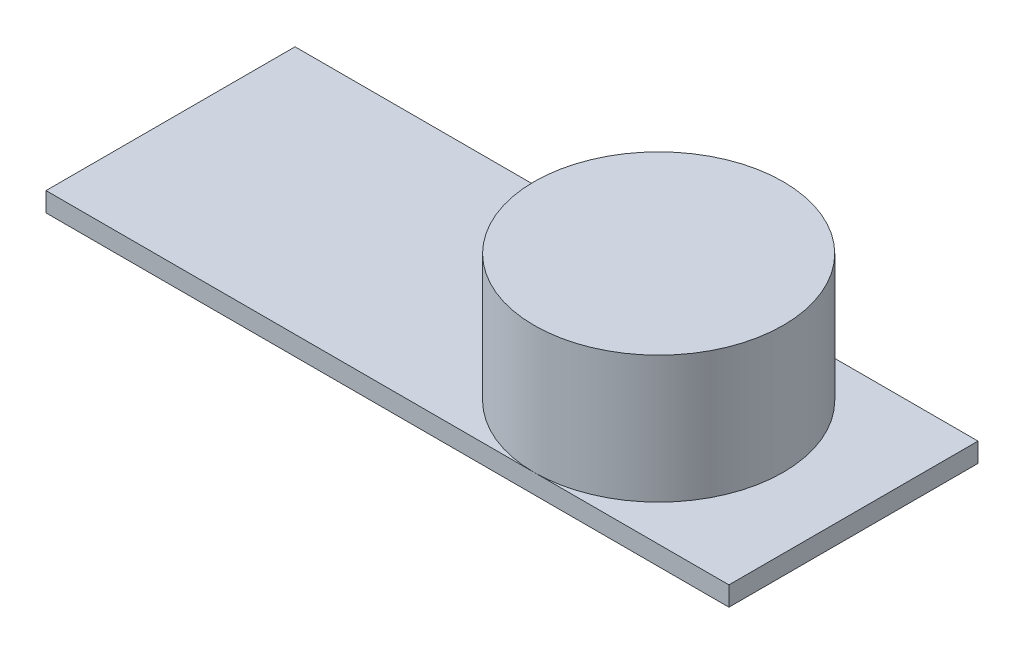
ISO-10303-21;
HEADER;
FILE_DESCRIPTION(('STEP AP214'),'2;1');
FILE_NAME('part.step','',(''),(''),'','','');
FILE_SCHEMA(('AUTOMOTIVE_DESIGN { 1 0 10303 214 1 1 1 1 }'));
ENDSEC;
DATA;
#1=APPLICATION_CONTEXT('core data for automotive mechanical design processes');
#2=APPLICATION_PROTOCOL_DEFINITION('international standard','automotive_design',2000,#1);
#3=PRODUCT_CONTEXT('',#1,'mechanical');
#4=PRODUCT('Part','Part','',(#3));
#5=PRODUCT_RELATED_PRODUCT_CATEGORY('part','',(#4));
#6=PRODUCT_DEFINITION_FORMATION('','',#4);
#7=PRODUCT_DEFINITION_CONTEXT('part definition',#1,'design');
#8=PRODUCT_DEFINITION('design','',#6,#7);
#9=PRODUCT_DEFINITION_SHAPE('','',#8);
#10=(LENGTH_UNIT() NAMED_UNIT(*) SI_UNIT(.MILLI.,.METRE.));
#11=(NAMED_UNIT(*) PLANE_ANGLE_UNIT() SI_UNIT($,.RADIAN.));
#12=(NAMED_UNIT(*) SI_UNIT($,.STERADIAN.) SOLID_ANGLE_UNIT());
#13=UNCERTAINTY_MEASURE_WITH_UNIT(LENGTH_MEASURE(1.E-05),#10,'distance_accuracy_value','');
#14=(GEOMETRIC_REPRESENTATION_CONTEXT(3) GLOBAL_UNCERTAINTY_ASSIGNED_CONTEXT((#13)) GLOBAL_UNIT_ASSIGNED_CONTEXT((#10,
#11,#12)) REPRESENTATION_CONTEXT('',''));
#15=CARTESIAN_POINT('',(0.,0.,0.));
#16=DIRECTION('',(0.,0.,1.));
#17=DIRECTION('',(1.,0.,0.));
#18=AXIS2_PLACEMENT_3D('',#15,#16,#17);
#19=CARTESIAN_POINT('',(0.,-1.15,0.));
#20=DIRECTION('',(0.,1.,0.));
#21=DIRECTION('',(0.,0.,1.));
#22=AXIS2_PLACEMENT_3D('',#19,#20,#21);
#23=CYLINDRICAL_SURFACE('',#22,2.25);
#24=CARTESIAN_POINT('',(0.,-1.15,0.));
#25=DIRECTION('',(0.,1.,0.));
#26=DIRECTION('',(0.,0.,1.));
#27=AXIS2_PLACEMENT_3D('',#24,#25,#26);
#28=CIRCLE('',#27,2.25);
#29=CARTESIAN_POINT('',(0.,-1.15,2.25));
#30=VERTEX_POINT('',#29);
#31=CARTESIAN_POINT('',(0.,-1.15,-2.25));
#32=VERTEX_POINT('',#31);
#33=EDGE_CURVE('E134',#30,#32,#28,.T.);
#34=ORIENTED_EDGE('',*,*,#33,.T.);
#35=EDGE_CURVE('E133',#32,#30,#28,.T.);
#36=ORIENTED_EDGE('',*,*,#35,.T.);
#37=EDGE_LOOP('',(#34,#36));
#38=FACE_BOUND('',#37,.T.);
#39=CARTESIAN_POINT('',(0.,1.15,0.));
#40=DIRECTION('',(0.,1.,0.));
#41=DIRECTION('',(0.,0.,1.));
#42=AXIS2_PLACEMENT_3D('',#39,#40,#41);
#43=CIRCLE('',#42,2.25);
#44=CARTESIAN_POINT('',(0.,1.15,2.25));
#45=VERTEX_POINT('',#44);
#46=EDGE_CURVE('E130',#45,#45,#43,.T.);
#47=ORIENTED_EDGE('',*,*,#46,.F.);
#48=EDGE_LOOP('',(#47));
#49=FACE_BOUND('',#48,.T.);
#50=ADVANCED_FACE('F38',(#38,#49),#23,.T.);
#51=CARTESIAN_POINT('',(0.,1.15,0.));
#52=DIRECTION('',(0.,1.,0.));
#53=DIRECTION('',(0.,0.,1.));
#54=AXIS2_PLACEMENT_3D('',#51,#52,#53);
#55=PLANE('',#54);
#56=ORIENTED_EDGE('',*,*,#46,.T.);
#57=EDGE_LOOP('',(#56));
#58=FACE_BOUND('',#57,.T.);
#59=ADVANCED_FACE('F163',(#58),#55,.T.);
#60=CARTESIAN_POINT('',(0.,-1.15,0.));
#61=DIRECTION('',(0.,-1.,0.));
#62=DIRECTION('',(0.,0.,-1.));
#63=AXIS2_PLACEMENT_3D('',#60,#61,#62);
#64=PLANE('',#63);
#65=ORIENTED_EDGE('',*,*,#33,.F.);
#66=DIRECTION('',(-1.,0.,0.));
#67=VECTOR('',#66,1.);
#68=CARTESIAN_POINT('',(-3.52,-1.15,2.25));
#69=LINE('',#68,#67);
#70=CARTESIAN_POINT('',(3.52,-1.15,2.25));
#71=VERTEX_POINT('',#70);
#72=EDGE_CURVE('E122',#71,#30,#69,.T.);
#73=ORIENTED_EDGE('',*,*,#72,.F.);
#74=DIRECTION('',(0.,0.,1.));
#75=VECTOR('',#74,1.);
#76=CARTESIAN_POINT('',(3.52,-1.15,2.25));
#77=LINE('',#76,#75);
#78=CARTESIAN_POINT('',(3.52,-1.15,-2.25));
#79=VERTEX_POINT('',#78);
#80=EDGE_CURVE('E118',#79,#71,#77,.T.);
#81=ORIENTED_EDGE('',*,*,#80,.F.);
#82=DIRECTION('',(1.,0.,0.));
#83=VECTOR('',#82,1.);
#84=CARTESIAN_POINT('',(-3.52,-1.15,-2.25));
#85=LINE('',#84,#83);
#86=EDGE_CURVE('E125',#32,#79,#85,.T.);
#87=ORIENTED_EDGE('',*,*,#86,.F.);
#88=EDGE_LOOP('',(#65,#73,#81,#87));
#89=FACE_BOUND('',#88,.T.);
#90=ADVANCED_FACE('F169',(#89),#64,.F.);
#91=CARTESIAN_POINT('',(3.52,-2.95,2.25));
#92=DIRECTION('',(-1.,0.,0.));
#93=DIRECTION('',(0.,0.,1.));
#94=AXIS2_PLACEMENT_3D('',#91,#92,#93);
#95=PLANE('',#94);
#96=DIRECTION('',(0.,1.,0.));
#97=VECTOR('',#96,1.);
#98=CARTESIAN_POINT('',(3.52,-2.95,2.25));
#99=LINE('',#98,#97);
#100=CARTESIAN_POINT('',(3.52,-1.49999999999999,2.25));
#101=VERTEX_POINT('',#100);
#102=EDGE_CURVE('E128',#101,#71,#99,.T.);
#103=ORIENTED_EDGE('',*,*,#102,.F.);
#104=DIRECTION('',(0.,0.,-1.));
#105=VECTOR('',#104,1.);
#106=CARTESIAN_POINT('',(3.52,-1.49999999999999,-2.25));
#107=LINE('',#106,#105);
#108=CARTESIAN_POINT('',(3.52,-1.49999999999999,-2.25));
#109=VERTEX_POINT('',#108);
#110=EDGE_CURVE('E46',#101,#109,#107,.T.);
#111=ORIENTED_EDGE('',*,*,#110,.T.);
#112=DIRECTION('',(0.,1.,0.));
#113=VECTOR('',#112,1.);
#114=CARTESIAN_POINT('',(3.52,-2.95,-2.25));
#115=LINE('',#114,#113);
#116=EDGE_CURVE('E112',#109,#79,#115,.T.);
#117=ORIENTED_EDGE('',*,*,#116,.T.);
#118=ORIENTED_EDGE('',*,*,#80,.T.);
#119=EDGE_LOOP('',(#103,#111,#117,#118));
#120=FACE_BOUND('',#119,.T.);
#121=ADVANCED_FACE('F155',(#120),#95,.F.);
#122=CARTESIAN_POINT('',(-3.52,-2.95,2.25));
#123=DIRECTION('',(0.,0.,-1.));
#124=DIRECTION('',(-1.,0.,0.));
#125=AXIS2_PLACEMENT_3D('',#122,#123,#124);
#126=PLANE('',#125);
#127=DIRECTION('',(0.,1.,0.));
#128=VECTOR('',#127,1.);
#129=CARTESIAN_POINT('',(-8.82,-2.95,2.25));
#130=LINE('',#129,#128);
#131=CARTESIAN_POINT('',(-8.82,-1.49999999999999,2.25));
#132=VERTEX_POINT('',#131);
#133=CARTESIAN_POINT('',(-8.82,-1.15,2.25));
#134=VERTEX_POINT('',#133);
#135=EDGE_CURVE('E111',#132,#134,#130,.T.);
#136=ORIENTED_EDGE('',*,*,#135,.F.);
#137=DIRECTION('',(1.,0.,0.));
#138=VECTOR('',#137,1.);
#139=CARTESIAN_POINT('',(3.52,-1.49999999999999,2.25));
#140=LINE('',#139,#138);
#141=EDGE_CURVE('E140',#132,#101,#140,.T.);
#142=ORIENTED_EDGE('',*,*,#141,.T.);
#143=ORIENTED_EDGE('',*,*,#102,.T.);
#144=ORIENTED_EDGE('',*,*,#72,.T.);
#145=EDGE_CURVE('E121',#30,#134,#69,.T.);
#146=ORIENTED_EDGE('',*,*,#145,.T.);
#147=EDGE_LOOP('',(#136,#142,#143,#144,#146));
#148=FACE_BOUND('',#147,.T.);
#149=ADVANCED_FACE('F152',(#148),#126,.F.);
#150=CARTESIAN_POINT('',(-8.82,-2.95,2.25));
#151=DIRECTION('',(1.,0.,0.));
#152=DIRECTION('',(0.,0.,-1.));
#153=AXIS2_PLACEMENT_3D('',#150,#151,#152);
#154=PLANE('',#153);
#155=DIRECTION('',(0.,0.,-1.));
#156=VECTOR('',#155,1.);
#157=CARTESIAN_POINT('',(-8.82,-2.95,2.25));
#158=LINE('',#157,#156);
#159=CARTESIAN_POINT('',(-8.82,-2.95,0.799999999999999));
#160=VERTEX_POINT('',#159);
#161=CARTESIAN_POINT('',(-8.82,-2.95,-2.25));
#162=VERTEX_POINT('',#161);
#163=EDGE_CURVE('E92',#160,#162,#158,.T.);
#164=ORIENTED_EDGE('',*,*,#163,.F.);
#165=DIRECTION('',(0.,0.707106781186549,0.707106781186546));
#166=VECTOR('',#165,1.);
#167=CARTESIAN_POINT('',(-8.82,-2.95,0.799999999999999));
#168=LINE('',#167,#166);
#169=EDGE_CURVE('E138',#160,#132,#168,.T.);
#170=ORIENTED_EDGE('',*,*,#169,.T.);
#171=ORIENTED_EDGE('',*,*,#135,.T.);
#172=DIRECTION('',(0.,0.,-1.));
#173=VECTOR('',#172,1.);
#174=CARTESIAN_POINT('',(-8.82,-1.15,2.25));
#175=LINE('',#174,#173);
#176=CARTESIAN_POINT('',(-8.82,-1.15,-2.25));
#177=VERTEX_POINT('',#176);
#178=EDGE_CURVE('E109',#134,#177,#175,.T.);
#179=ORIENTED_EDGE('',*,*,#178,.T.);
#180=DIRECTION('',(0.,1.,0.));
#181=VECTOR('',#180,1.);
#182=CARTESIAN_POINT('',(-8.82,-2.95,-2.25));
#183=LINE('',#182,#181);
#184=EDGE_CURVE('E106',#162,#177,#183,.T.);
#185=ORIENTED_EDGE('',*,*,#184,.F.);
#186=EDGE_LOOP('',(#164,#170,#171,#179,#185));
#187=FACE_BOUND('',#186,.T.);
#188=ADVANCED_FACE('F107',(#187),#154,.F.);
#189=CARTESIAN_POINT('',(-3.52,-2.95,-2.25));
#190=DIRECTION('',(0.,0.,1.));
#191=DIRECTION('',(1.,0.,0.));
#192=AXIS2_PLACEMENT_3D('',#189,#190,#191);
#193=PLANE('',#192);
#194=ORIENTED_EDGE('',*,*,#116,.F.);
#195=DIRECTION('',(-0.707106781186546,-0.707106781186549,0.));
#196=VECTOR('',#195,1.);
#197=CARTESIAN_POINT('',(2.07,-2.95,-2.25));
#198=LINE('',#197,#196);
#199=CARTESIAN_POINT('',(2.07,-2.95,-2.25));
#200=VERTEX_POINT('',#199);
#201=EDGE_CURVE('E11',#109,#200,#198,.T.);
#202=ORIENTED_EDGE('',*,*,#201,.T.);
#203=DIRECTION('',(1.,0.,0.));
#204=VECTOR('',#203,1.);
#205=CARTESIAN_POINT('',(-3.52,-2.95,-2.25));
#206=LINE('',#205,#204);
#207=EDGE_CURVE('E96',#162,#200,#206,.T.);
#208=ORIENTED_EDGE('',*,*,#207,.F.);
#209=ORIENTED_EDGE('',*,*,#184,.T.);
#210=EDGE_CURVE('E102',#177,#32,#85,.T.);
#211=ORIENTED_EDGE('',*,*,#210,.T.);
#212=ORIENTED_EDGE('',*,*,#86,.T.);
#213=EDGE_LOOP('',(#194,#202,#208,#209,#211,#212));
#214=FACE_BOUND('',#213,.T.);
#215=ADVANCED_FACE('F114',(#214),#193,.F.);
#216=CARTESIAN_POINT('',(0.,-2.95,0.));
#217=DIRECTION('',(0.,-1.,0.));
#218=DIRECTION('',(0.,0.,-1.));
#219=AXIS2_PLACEMENT_3D('',#216,#217,#218);
#220=PLANE('',#219);
#221=ORIENTED_EDGE('',*,*,#207,.T.);
#222=DIRECTION('',(0.,0.,1.));
#223=VECTOR('',#222,1.);
#224=CARTESIAN_POINT('',(2.07,-2.95,0.799999999999999));
#225=LINE('',#224,#223);
#226=CARTESIAN_POINT('',(2.07,-2.95,0.799999999999999));
#227=VERTEX_POINT('',#226);
#228=EDGE_CURVE('E143',#200,#227,#225,.T.);
#229=ORIENTED_EDGE('',*,*,#228,.T.);
#230=DIRECTION('',(-1.,0.,0.));
#231=VECTOR('',#230,1.);
#232=CARTESIAN_POINT('',(-8.82,-2.95,0.799999999999999));
#233=LINE('',#232,#231);
#234=EDGE_CURVE('E99',#227,#160,#233,.T.);
#235=ORIENTED_EDGE('',*,*,#234,.T.);
#236=ORIENTED_EDGE('',*,*,#163,.T.);
#237=EDGE_LOOP('',(#221,#229,#235,#236));
#238=FACE_BOUND('',#237,.T.);
#239=ADVANCED_FACE('F94',(#238),#220,.T.);
#240=ORIENTED_EDGE('',*,*,#35,.F.);
#241=ORIENTED_EDGE('',*,*,#210,.F.);
#242=ORIENTED_EDGE('',*,*,#178,.F.);
#243=ORIENTED_EDGE('',*,*,#145,.F.);
#244=EDGE_LOOP('',(#240,#241,#242,#243));
#245=FACE_BOUND('',#244,.T.);
#246=ADVANCED_FACE('F161',(#245),#64,.F.);
#247=CARTESIAN_POINT('',(0.,-2.95,0.799999999999999));
#248=DIRECTION('',(0.,-0.707106781186546,0.707106781186549));
#249=DIRECTION('',(1.,0.,0.));
#250=AXIS2_PLACEMENT_3D('',#247,#248,#249);
#251=PLANE('',#250);
#252=ORIENTED_EDGE('',*,*,#234,.F.);
#253=DIRECTION('',(0.577350269189625,0.577350269189627,0.577350269189625));
#254=VECTOR('',#253,1.);
#255=CARTESIAN_POINT('',(1.38,-3.64,0.110000000000001));
#256=LINE('',#255,#254);
#257=EDGE_CURVE('E145',#227,#101,#256,.T.);
#258=ORIENTED_EDGE('',*,*,#257,.T.);
#259=ORIENTED_EDGE('',*,*,#141,.F.);
#260=ORIENTED_EDGE('',*,*,#169,.F.);
#261=EDGE_LOOP('',(#252,#258,#259,#260));
#262=FACE_BOUND('',#261,.T.);
#263=ADVANCED_FACE('F148',(#262),#251,.T.);
#264=CARTESIAN_POINT('',(2.07,-2.95,0.));
#265=DIRECTION('',(0.707106781186549,-0.707106781186546,0.));
#266=DIRECTION('',(0.,0.,-1.));
#267=AXIS2_PLACEMENT_3D('',#264,#265,#266);
#268=PLANE('',#267);
#269=ORIENTED_EDGE('',*,*,#201,.F.);
#270=ORIENTED_EDGE('',*,*,#110,.F.);
#271=ORIENTED_EDGE('',*,*,#257,.F.);
#272=ORIENTED_EDGE('',*,*,#228,.F.);
#273=EDGE_LOOP('',(#269,#270,#271,#272));
#274=FACE_BOUND('',#273,.T.);
#275=ADVANCED_FACE('F40',(#274),#268,.T.);
#276=CLOSED_SHELL('',(#50,#59,#90,#121,#149,#188,#215,#239,#246,#263,#275));
#277=MANIFOLD_SOLID_BREP('B2',#276);
#278=ADVANCED_BREP_SHAPE_REPRESENTATION('',(#18,#277),#14);
#279=SHAPE_DEFINITION_REPRESENTATION(#9,#278);
ENDSEC;
END-ISO-10303-21;
